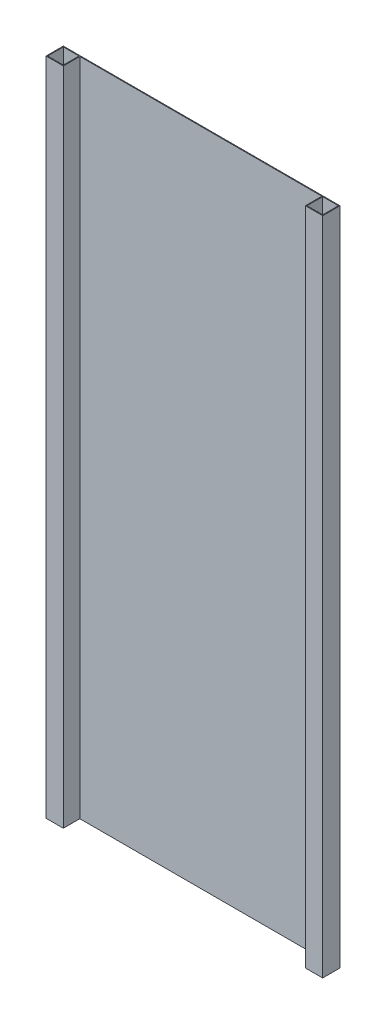
ISO-10303-21;
HEADER;
FILE_DESCRIPTION(('STEP AP214'),'2;1');
FILE_NAME('part.step','',(''),(''),'','','');
FILE_SCHEMA(('AUTOMOTIVE_DESIGN { 1 0 10303 214 1 1 1 1 }'));
ENDSEC;
DATA;
#1=APPLICATION_CONTEXT('core data for automotive mechanical design processes');
#2=APPLICATION_PROTOCOL_DEFINITION('international standard','automotive_design',2000,#1);
#3=PRODUCT_CONTEXT('',#1,'mechanical');
#4=PRODUCT('Part','Part','',(#3));
#5=PRODUCT_RELATED_PRODUCT_CATEGORY('part','',(#4));
#6=PRODUCT_DEFINITION_FORMATION('','',#4);
#7=PRODUCT_DEFINITION_CONTEXT('part definition',#1,'design');
#8=PRODUCT_DEFINITION('design','',#6,#7);
#9=PRODUCT_DEFINITION_SHAPE('','',#8);
#10=(LENGTH_UNIT() NAMED_UNIT(*) SI_UNIT(.MILLI.,.METRE.));
#11=(NAMED_UNIT(*) PLANE_ANGLE_UNIT() SI_UNIT($,.RADIAN.));
#12=(NAMED_UNIT(*) SI_UNIT($,.STERADIAN.) SOLID_ANGLE_UNIT());
#13=UNCERTAINTY_MEASURE_WITH_UNIT(LENGTH_MEASURE(1.E-05),#10,'distance_accuracy_value','');
#14=(GEOMETRIC_REPRESENTATION_CONTEXT(3) GLOBAL_UNCERTAINTY_ASSIGNED_CONTEXT((#13)) GLOBAL_UNIT_ASSIGNED_CONTEXT((#10,
#11,#12)) REPRESENTATION_CONTEXT('',''));
#15=CARTESIAN_POINT('',(0.,0.,0.));
#16=DIRECTION('',(0.,0.,1.));
#17=DIRECTION('',(1.,0.,0.));
#18=AXIS2_PLACEMENT_3D('',#15,#16,#17);
#19=CARTESIAN_POINT('',(-2.64939585421912E-13,840.,1.));
#20=DIRECTION('',(0.,-1.,0.));
#21=DIRECTION('',(1.,0.,0.));
#22=AXIS2_PLACEMENT_3D('',#19,#20,#21);
#23=PLANE('',#22);
#24=DIRECTION('',(-1.,0.,0.));
#25=VECTOR('',#24,1.);
#26=CARTESIAN_POINT('',(-2.64939585421912E-13,840.,0.));
#27=LINE('',#26,#25);
#28=CARTESIAN_POINT('',(0.,840.,0.));
#29=VERTEX_POINT('',#28);
#30=CARTESIAN_POINT('',(-352.,840.,0.));
#31=VERTEX_POINT('',#30);
#32=EDGE_CURVE('E262',#29,#31,#27,.T.);
#33=ORIENTED_EDGE('',*,*,#32,.T.);
#34=DIRECTION('',(0.,0.,-1.));
#35=VECTOR('',#34,1.);
#36=CARTESIAN_POINT('',(-352.,840.,22.));
#37=LINE('',#36,#35);
#38=CARTESIAN_POINT('',(-352.,840.,22.));
#39=VERTEX_POINT('',#38);
#40=EDGE_CURVE('E231',#39,#31,#37,.T.);
#41=ORIENTED_EDGE('',*,*,#40,.F.);
#42=DIRECTION('',(-1.,0.,0.));
#43=VECTOR('',#42,1.);
#44=CARTESIAN_POINT('',(-2.64939585421912E-13,840.,22.));
#45=LINE('',#44,#43);
#46=CARTESIAN_POINT('',(-330.,840.,22.));
#47=VERTEX_POINT('',#46);
#48=EDGE_CURVE('E216',#47,#39,#45,.T.);
#49=ORIENTED_EDGE('',*,*,#48,.F.);
#50=DIRECTION('',(0.,0.,-1.));
#51=VECTOR('',#50,1.);
#52=CARTESIAN_POINT('',(-330.,840.,22.));
#53=LINE('',#52,#51);
#54=CARTESIAN_POINT('',(-330.,840.,1.));
#55=VERTEX_POINT('',#54);
#56=EDGE_CURVE('E234',#47,#55,#53,.T.);
#57=ORIENTED_EDGE('',*,*,#56,.T.);
#58=DIRECTION('',(-1.,0.,0.));
#59=VECTOR('',#58,1.);
#60=CARTESIAN_POINT('',(-2.64939585421912E-13,840.,1.));
#61=LINE('',#60,#59);
#62=CARTESIAN_POINT('',(-21.9999999999999,840.,1.));
#63=VERTEX_POINT('',#62);
#64=EDGE_CURVE('E263',#63,#55,#61,.T.);
#65=ORIENTED_EDGE('',*,*,#64,.F.);
#66=DIRECTION('',(0.,0.,-1.));
#67=VECTOR('',#66,1.);
#68=CARTESIAN_POINT('',(-21.9999999999999,840.,22.));
#69=LINE('',#68,#67);
#70=CARTESIAN_POINT('',(-21.9999999999999,840.,22.));
#71=VERTEX_POINT('',#70);
#72=EDGE_CURVE('E256',#71,#63,#69,.T.);
#73=ORIENTED_EDGE('',*,*,#72,.F.);
#74=DIRECTION('',(-1.,0.,0.));
#75=VECTOR('',#74,1.);
#76=CARTESIAN_POINT('',(-2.64939585421912E-13,840.,22.));
#77=LINE('',#76,#75);
#78=CARTESIAN_POINT('',(0.,840.,22.));
#79=VERTEX_POINT('',#78);
#80=EDGE_CURVE('E241',#79,#71,#77,.T.);
#81=ORIENTED_EDGE('',*,*,#80,.F.);
#82=DIRECTION('',(0.,0.,-1.));
#83=VECTOR('',#82,1.);
#84=CARTESIAN_POINT('',(0.,840.,22.));
#85=LINE('',#84,#83);
#86=EDGE_CURVE('E259',#79,#29,#85,.T.);
#87=ORIENTED_EDGE('',*,*,#86,.T.);
#88=EDGE_LOOP('',(#33,#41,#49,#57,#65,#73,#81,#87));
#89=FACE_BOUND('',#88,.T.);
#90=DIRECTION('',(0.,0.,-1.));
#91=VECTOR('',#90,1.);
#92=CARTESIAN_POINT('',(-1.,840.,0.));
#93=LINE('',#92,#91);
#94=CARTESIAN_POINT('',(-0.999999999999999,840.,21.));
#95=VERTEX_POINT('',#94);
#96=CARTESIAN_POINT('',(-0.999999999999999,840.,0.999999999999995));
#97=VERTEX_POINT('',#96);
#98=EDGE_CURVE('E196',#95,#97,#93,.T.);
#99=ORIENTED_EDGE('',*,*,#98,.F.);
#100=DIRECTION('',(1.,0.,0.));
#101=VECTOR('',#100,1.);
#102=CARTESIAN_POINT('',(-3.39780737724104E-13,840.,21.));
#103=LINE('',#102,#101);
#104=CARTESIAN_POINT('',(-20.9999999999999,840.,21.));
#105=VERTEX_POINT('',#104);
#106=EDGE_CURVE('E177',#105,#95,#103,.T.);
#107=ORIENTED_EDGE('',*,*,#106,.F.);
#108=DIRECTION('',(0.,0.,1.));
#109=VECTOR('',#108,1.);
#110=CARTESIAN_POINT('',(-20.9999999999999,840.,0.));
#111=LINE('',#110,#109);
#112=CARTESIAN_POINT('',(-20.9999999999999,840.,0.999999999999997));
#113=VERTEX_POINT('',#112);
#114=EDGE_CURVE('E185',#113,#105,#111,.T.);
#115=ORIENTED_EDGE('',*,*,#114,.F.);
#116=DIRECTION('',(-1.,0.,0.));
#117=VECTOR('',#116,1.);
#118=CARTESIAN_POINT('',(-3.39677480374344E-13,840.,0.999999999999995));
#119=LINE('',#118,#117);
#120=EDGE_CURVE('E199',#97,#113,#119,.T.);
#121=ORIENTED_EDGE('',*,*,#120,.F.);
#122=EDGE_LOOP('',(#99,#107,#115,#121));
#123=FACE_BOUND('',#122,.T.);
#124=DIRECTION('',(-1.,0.,0.));
#125=VECTOR('',#124,1.);
#126=CARTESIAN_POINT('',(-3.36137818424553E-13,840.,20.9999999999999));
#127=LINE('',#126,#125);
#128=CARTESIAN_POINT('',(-331.,840.,21.));
#129=VERTEX_POINT('',#128);
#130=CARTESIAN_POINT('',(-351.,840.,21.));
#131=VERTEX_POINT('',#130);
#132=EDGE_CURVE('E48',#129,#131,#127,.T.);
#133=ORIENTED_EDGE('',*,*,#132,.T.);
#134=DIRECTION('',(0.,0.,-1.));
#135=VECTOR('',#134,1.);
#136=CARTESIAN_POINT('',(-351.,840.,0.));
#137=LINE('',#136,#135);
#138=CARTESIAN_POINT('',(-351.,840.,1.));
#139=VERTEX_POINT('',#138);
#140=EDGE_CURVE('E162',#131,#139,#137,.T.);
#141=ORIENTED_EDGE('',*,*,#140,.T.);
#142=DIRECTION('',(1.,0.,0.));
#143=VECTOR('',#142,1.);
#144=CARTESIAN_POINT('',(-3.39780737724104E-13,840.,1.));
#145=LINE('',#144,#143);
#146=CARTESIAN_POINT('',(-331.,840.,1.));
#147=VERTEX_POINT('',#146);
#148=EDGE_CURVE('E165',#139,#147,#145,.T.);
#149=ORIENTED_EDGE('',*,*,#148,.T.);
#150=DIRECTION('',(0.,0.,1.));
#151=VECTOR('',#150,1.);
#152=CARTESIAN_POINT('',(-331.,840.,0.));
#153=LINE('',#152,#151);
#154=EDGE_CURVE('E171',#147,#129,#153,.T.);
#155=ORIENTED_EDGE('',*,*,#154,.T.);
#156=EDGE_LOOP('',(#133,#141,#149,#155));
#157=FACE_BOUND('',#156,.T.);
#158=ADVANCED_FACE('F32',(#89,#123,#157),#23,.F.);
#159=CARTESIAN_POINT('',(0.,0.,1.));
#160=DIRECTION('',(0.,-1.,0.));
#161=DIRECTION('',(1.,0.,0.));
#162=AXIS2_PLACEMENT_3D('',#159,#160,#161);
#163=PLANE('',#162);
#164=DIRECTION('',(1.,0.,0.));
#165=VECTOR('',#164,1.);
#166=CARTESIAN_POINT('',(0.,2.22044604925031E-13,21.));
#167=LINE('',#166,#165);
#168=CARTESIAN_POINT('',(-20.9999999999996,2.22044604925031E-13,21.));
#169=VERTEX_POINT('',#168);
#170=CARTESIAN_POINT('',(-0.999999999999734,2.22044604925031E-13,21.));
#171=VERTEX_POINT('',#170);
#172=EDGE_CURVE('E181',#169,#171,#167,.T.);
#173=ORIENTED_EDGE('',*,*,#172,.T.);
#174=DIRECTION('',(0.,0.,-1.));
#175=VECTOR('',#174,1.);
#176=CARTESIAN_POINT('',(-0.999999999999735,2.22044604925031E-13,0.));
#177=LINE('',#176,#175);
#178=CARTESIAN_POINT('',(-0.999999999999735,0.,0.999999999999995));
#179=VERTEX_POINT('',#178);
#180=EDGE_CURVE('E184',#171,#179,#177,.T.);
#181=ORIENTED_EDGE('',*,*,#180,.T.);
#182=DIRECTION('',(-1.,0.,0.));
#183=VECTOR('',#182,1.);
#184=CARTESIAN_POINT('',(0.,2.22044604925031E-13,0.999999999999995));
#185=LINE('',#184,#183);
#186=CARTESIAN_POINT('',(-20.9999999999996,2.22044604925031E-13,0.999999999999997));
#187=VERTEX_POINT('',#186);
#188=EDGE_CURVE('E188',#179,#187,#185,.T.);
#189=ORIENTED_EDGE('',*,*,#188,.T.);
#190=DIRECTION('',(0.,0.,1.));
#191=VECTOR('',#190,1.);
#192=CARTESIAN_POINT('',(-20.9999999999996,2.22044604925031E-13,0.));
#193=LINE('',#192,#191);
#194=EDGE_CURVE('E191',#187,#169,#193,.T.);
#195=ORIENTED_EDGE('',*,*,#194,.T.);
#196=EDGE_LOOP('',(#173,#181,#189,#195));
#197=FACE_BOUND('',#196,.T.);
#198=DIRECTION('',(-1.,0.,0.));
#199=VECTOR('',#198,1.);
#200=CARTESIAN_POINT('',(0.,0.,0.));
#201=LINE('',#200,#199);
#202=CARTESIAN_POINT('',(0.,0.,0.));
#203=VERTEX_POINT('',#202);
#204=CARTESIAN_POINT('',(-352.,0.,0.));
#205=VERTEX_POINT('',#204);
#206=EDGE_CURVE('E35',#203,#205,#201,.T.);
#207=ORIENTED_EDGE('',*,*,#206,.F.);
#208=DIRECTION('',(0.,0.,-1.));
#209=VECTOR('',#208,1.);
#210=CARTESIAN_POINT('',(0.,0.,22.));
#211=LINE('',#210,#209);
#212=CARTESIAN_POINT('',(0.,0.,22.));
#213=VERTEX_POINT('',#212);
#214=EDGE_CURVE('E248',#213,#203,#211,.T.);
#215=ORIENTED_EDGE('',*,*,#214,.F.);
#216=DIRECTION('',(-1.,0.,0.));
#217=VECTOR('',#216,1.);
#218=CARTESIAN_POINT('',(0.,0.,22.));
#219=LINE('',#218,#217);
#220=CARTESIAN_POINT('',(-21.9999999999999,0.,22.));
#221=VERTEX_POINT('',#220);
#222=EDGE_CURVE('E245',#213,#221,#219,.T.);
#223=ORIENTED_EDGE('',*,*,#222,.T.);
#224=DIRECTION('',(0.,0.,-1.));
#225=VECTOR('',#224,1.);
#226=CARTESIAN_POINT('',(-21.9999999999999,0.,22.));
#227=LINE('',#226,#225);
#228=CARTESIAN_POINT('',(-21.9999999999999,0.,1.));
#229=VERTEX_POINT('',#228);
#230=EDGE_CURVE('E253',#221,#229,#227,.T.);
#231=ORIENTED_EDGE('',*,*,#230,.T.);
#232=DIRECTION('',(-1.,0.,0.));
#233=VECTOR('',#232,1.);
#234=CARTESIAN_POINT('',(0.,0.,1.));
#235=LINE('',#234,#233);
#236=CARTESIAN_POINT('',(-330.,0.,1.));
#237=VERTEX_POINT('',#236);
#238=EDGE_CURVE('E40',#229,#237,#235,.T.);
#239=ORIENTED_EDGE('',*,*,#238,.T.);
#240=DIRECTION('',(0.,0.,-1.));
#241=VECTOR('',#240,1.);
#242=CARTESIAN_POINT('',(-330.,0.,22.));
#243=LINE('',#242,#241);
#244=CARTESIAN_POINT('',(-330.,0.,22.));
#245=VERTEX_POINT('',#244);
#246=EDGE_CURVE('E224',#245,#237,#243,.T.);
#247=ORIENTED_EDGE('',*,*,#246,.F.);
#248=DIRECTION('',(-1.,0.,0.));
#249=VECTOR('',#248,1.);
#250=CARTESIAN_POINT('',(0.,0.,22.));
#251=LINE('',#250,#249);
#252=CARTESIAN_POINT('',(-352.,0.,22.));
#253=VERTEX_POINT('',#252);
#254=EDGE_CURVE('E221',#245,#253,#251,.T.);
#255=ORIENTED_EDGE('',*,*,#254,.T.);
#256=DIRECTION('',(0.,0.,-1.));
#257=VECTOR('',#256,1.);
#258=CARTESIAN_POINT('',(-352.,0.,22.));
#259=LINE('',#258,#257);
#260=EDGE_CURVE('E228',#253,#205,#259,.T.);
#261=ORIENTED_EDGE('',*,*,#260,.T.);
#262=EDGE_LOOP('',(#207,#215,#223,#231,#239,#247,#255,#261));
#263=FACE_BOUND('',#262,.T.);
#264=DIRECTION('',(0.,0.,-1.));
#265=VECTOR('',#264,1.);
#266=CARTESIAN_POINT('',(-351.,1.11022302462516E-13,0.));
#267=LINE('',#266,#265);
#268=CARTESIAN_POINT('',(-351.,1.11022302462516E-13,21.));
#269=VERTEX_POINT('',#268);
#270=CARTESIAN_POINT('',(-351.,1.11022302462516E-13,1.));
#271=VERTEX_POINT('',#270);
#272=EDGE_CURVE('E158',#269,#271,#267,.T.);
#273=ORIENTED_EDGE('',*,*,#272,.F.);
#274=DIRECTION('',(-1.,0.,0.));
#275=VECTOR('',#274,1.);
#276=CARTESIAN_POINT('',(0.,2.22044604925031E-13,20.9999999999999));
#277=LINE('',#276,#275);
#278=CARTESIAN_POINT('',(-331.,1.11022302462516E-13,21.));
#279=VERTEX_POINT('',#278);
#280=EDGE_CURVE('E154',#279,#269,#277,.T.);
#281=ORIENTED_EDGE('',*,*,#280,.F.);
#282=DIRECTION('',(0.,0.,1.));
#283=VECTOR('',#282,1.);
#284=CARTESIAN_POINT('',(-331.,1.11022302462516E-13,0.));
#285=LINE('',#284,#283);
#286=CARTESIAN_POINT('',(-331.,0.,1.));
#287=VERTEX_POINT('',#286);
#288=EDGE_CURVE('E146',#287,#279,#285,.T.);
#289=ORIENTED_EDGE('',*,*,#288,.F.);
#290=DIRECTION('',(1.,0.,0.));
#291=VECTOR('',#290,1.);
#292=CARTESIAN_POINT('',(0.,2.22044604925031E-13,1.));
#293=LINE('',#292,#291);
#294=EDGE_CURVE('E153',#271,#287,#293,.T.);
#295=ORIENTED_EDGE('',*,*,#294,.F.);
#296=EDGE_LOOP('',(#273,#281,#289,#295));
#297=FACE_BOUND('',#296,.T.);
#298=ADVANCED_FACE('F161',(#197,#263,#297),#163,.T.);
#299=CARTESIAN_POINT('',(0.,0.,1.));
#300=DIRECTION('',(0.,0.,1.));
#301=DIRECTION('',(1.,0.,0.));
#302=AXIS2_PLACEMENT_3D('',#299,#300,#301);
#303=PLANE('',#302);
#304=ORIENTED_EDGE('',*,*,#64,.T.);
#305=DIRECTION('',(0.,-1.,0.));
#306=VECTOR('',#305,1.);
#307=CARTESIAN_POINT('',(-330.,0.,1.));
#308=LINE('',#307,#306);
#309=EDGE_CURVE('E266',#55,#237,#308,.T.);
#310=ORIENTED_EDGE('',*,*,#309,.T.);
#311=ORIENTED_EDGE('',*,*,#238,.F.);
#312=DIRECTION('',(0.,-1.,0.));
#313=VECTOR('',#312,1.);
#314=CARTESIAN_POINT('',(-21.9999999999999,0.,1.));
#315=LINE('',#314,#313);
#316=EDGE_CURVE('E11',#63,#229,#315,.T.);
#317=ORIENTED_EDGE('',*,*,#316,.F.);
#318=EDGE_LOOP('',(#304,#310,#311,#317));
#319=FACE_BOUND('',#318,.T.);
#320=ADVANCED_FACE('F289',(#319),#303,.T.);
#321=CARTESIAN_POINT('',(0.,0.,0.));
#322=DIRECTION('',(0.,0.,1.));
#323=DIRECTION('',(1.,0.,0.));
#324=AXIS2_PLACEMENT_3D('',#321,#322,#323);
#325=PLANE('',#324);
#326=ORIENTED_EDGE('',*,*,#32,.F.);
#327=DIRECTION('',(0.,1.,0.));
#328=VECTOR('',#327,1.);
#329=CARTESIAN_POINT('',(0.,0.,0.));
#330=LINE('',#329,#328);
#331=EDGE_CURVE('E237',#203,#29,#330,.T.);
#332=ORIENTED_EDGE('',*,*,#331,.F.);
#333=ORIENTED_EDGE('',*,*,#206,.T.);
#334=DIRECTION('',(0.,1.,0.));
#335=VECTOR('',#334,1.);
#336=CARTESIAN_POINT('',(-352.,0.,0.));
#337=LINE('',#336,#335);
#338=EDGE_CURVE('E206',#205,#31,#337,.T.);
#339=ORIENTED_EDGE('',*,*,#338,.T.);
#340=EDGE_LOOP('',(#326,#332,#333,#339));
#341=FACE_BOUND('',#340,.T.);
#342=ADVANCED_FACE('F274',(#341),#325,.F.);
#343=CARTESIAN_POINT('',(-21.9999999999999,0.,22.));
#344=DIRECTION('',(1.,0.,0.));
#345=DIRECTION('',(0.,0.,-1.));
#346=AXIS2_PLACEMENT_3D('',#343,#344,#345);
#347=PLANE('',#346);
#348=ORIENTED_EDGE('',*,*,#72,.T.);
#349=ORIENTED_EDGE('',*,*,#316,.T.);
#350=ORIENTED_EDGE('',*,*,#230,.F.);
#351=DIRECTION('',(0.,-1.,0.));
#352=VECTOR('',#351,1.);
#353=CARTESIAN_POINT('',(-21.9999999999999,0.,22.));
#354=LINE('',#353,#352);
#355=EDGE_CURVE('E243',#71,#221,#354,.T.);
#356=ORIENTED_EDGE('',*,*,#355,.F.);
#357=EDGE_LOOP('',(#348,#349,#350,#356));
#358=FACE_BOUND('',#357,.T.);
#359=ADVANCED_FACE('F295',(#358),#347,.F.);
#360=CARTESIAN_POINT('',(0.,0.,22.));
#361=DIRECTION('',(-1.,0.,0.));
#362=DIRECTION('',(0.,0.,1.));
#363=AXIS2_PLACEMENT_3D('',#360,#361,#362);
#364=PLANE('',#363);
#365=ORIENTED_EDGE('',*,*,#331,.T.);
#366=ORIENTED_EDGE('',*,*,#86,.F.);
#367=DIRECTION('',(0.,1.,0.));
#368=VECTOR('',#367,1.);
#369=CARTESIAN_POINT('',(0.,0.,22.));
#370=LINE('',#369,#368);
#371=EDGE_CURVE('E238',#213,#79,#370,.T.);
#372=ORIENTED_EDGE('',*,*,#371,.F.);
#373=ORIENTED_EDGE('',*,*,#214,.T.);
#374=EDGE_LOOP('',(#365,#366,#372,#373));
#375=FACE_BOUND('',#374,.T.);
#376=ADVANCED_FACE('F302',(#375),#364,.F.);
#377=CARTESIAN_POINT('',(0.,0.,22.));
#378=DIRECTION('',(0.,0.,1.));
#379=DIRECTION('',(1.,0.,0.));
#380=AXIS2_PLACEMENT_3D('',#377,#378,#379);
#381=PLANE('',#380);
#382=ORIENTED_EDGE('',*,*,#371,.T.);
#383=ORIENTED_EDGE('',*,*,#80,.T.);
#384=ORIENTED_EDGE('',*,*,#355,.T.);
#385=ORIENTED_EDGE('',*,*,#222,.F.);
#386=EDGE_LOOP('',(#382,#383,#384,#385));
#387=FACE_BOUND('',#386,.T.);
#388=ADVANCED_FACE('F300',(#387),#381,.T.);
#389=CARTESIAN_POINT('',(-330.,0.,22.));
#390=DIRECTION('',(1.,0.,0.));
#391=DIRECTION('',(0.,0.,-1.));
#392=AXIS2_PLACEMENT_3D('',#389,#390,#391);
#393=PLANE('',#392);
#394=ORIENTED_EDGE('',*,*,#309,.F.);
#395=ORIENTED_EDGE('',*,*,#56,.F.);
#396=DIRECTION('',(0.,-1.,0.));
#397=VECTOR('',#396,1.);
#398=CARTESIAN_POINT('',(-330.,0.,22.));
#399=LINE('',#398,#397);
#400=EDGE_CURVE('E213',#47,#245,#399,.T.);
#401=ORIENTED_EDGE('',*,*,#400,.T.);
#402=ORIENTED_EDGE('',*,*,#246,.T.);
#403=EDGE_LOOP('',(#394,#395,#401,#402));
#404=FACE_BOUND('',#403,.T.);
#405=ADVANCED_FACE('F287',(#404),#393,.T.);
#406=CARTESIAN_POINT('',(-352.,0.,22.));
#407=DIRECTION('',(-1.,0.,0.));
#408=DIRECTION('',(0.,-1.,0.));
#409=AXIS2_PLACEMENT_3D('',#406,#407,#408);
#410=PLANE('',#409);
#411=ORIENTED_EDGE('',*,*,#338,.F.);
#412=ORIENTED_EDGE('',*,*,#260,.F.);
#413=DIRECTION('',(0.,1.,0.));
#414=VECTOR('',#413,1.);
#415=CARTESIAN_POINT('',(-352.,0.,22.));
#416=LINE('',#415,#414);
#417=EDGE_CURVE('E218',#253,#39,#416,.T.);
#418=ORIENTED_EDGE('',*,*,#417,.T.);
#419=ORIENTED_EDGE('',*,*,#40,.T.);
#420=EDGE_LOOP('',(#411,#412,#418,#419));
#421=FACE_BOUND('',#420,.T.);
#422=ADVANCED_FACE('F280',(#421),#410,.T.);
#423=CARTESIAN_POINT('',(0.,0.,22.));
#424=DIRECTION('',(0.,0.,1.));
#425=DIRECTION('',(1.,0.,0.));
#426=AXIS2_PLACEMENT_3D('',#423,#424,#425);
#427=PLANE('',#426);
#428=ORIENTED_EDGE('',*,*,#400,.F.);
#429=ORIENTED_EDGE('',*,*,#48,.T.);
#430=ORIENTED_EDGE('',*,*,#417,.F.);
#431=ORIENTED_EDGE('',*,*,#254,.F.);
#432=EDGE_LOOP('',(#428,#429,#430,#431));
#433=FACE_BOUND('',#432,.T.);
#434=ADVANCED_FACE('F285',(#433),#427,.T.);
#435=CARTESIAN_POINT('',(0.,2.22044604925031E-13,21.));
#436=DIRECTION('',(0.,0.,1.));
#437=DIRECTION('',(1.,0.,0.));
#438=AXIS2_PLACEMENT_3D('',#435,#436,#437);
#439=PLANE('',#438);
#440=ORIENTED_EDGE('',*,*,#106,.T.);
#441=DIRECTION('',(0.,1.,0.));
#442=VECTOR('',#441,1.);
#443=CARTESIAN_POINT('',(-0.999999999999734,2.22044604925031E-13,21.));
#444=LINE('',#443,#442);
#445=EDGE_CURVE('E194',#171,#95,#444,.T.);
#446=ORIENTED_EDGE('',*,*,#445,.F.);
#447=ORIENTED_EDGE('',*,*,#172,.F.);
#448=DIRECTION('',(0.,1.,0.));
#449=VECTOR('',#448,1.);
#450=CARTESIAN_POINT('',(-20.9999999999996,2.22044604925031E-13,21.));
#451=LINE('',#450,#449);
#452=EDGE_CURVE('E204',#169,#105,#451,.T.);
#453=ORIENTED_EDGE('',*,*,#452,.T.);
#454=EDGE_LOOP('',(#440,#446,#447,#453));
#455=FACE_BOUND('',#454,.T.);
#456=ADVANCED_FACE('F367',(#455),#439,.F.);
#457=CARTESIAN_POINT('',(-20.9999999999996,2.22044604925031E-13,0.));
#458=DIRECTION('',(-1.,0.,0.));
#459=DIRECTION('',(0.,-1.,0.));
#460=AXIS2_PLACEMENT_3D('',#457,#458,#459);
#461=PLANE('',#460);
#462=ORIENTED_EDGE('',*,*,#114,.T.);
#463=ORIENTED_EDGE('',*,*,#452,.F.);
#464=ORIENTED_EDGE('',*,*,#194,.F.);
#465=DIRECTION('',(0.,1.,0.));
#466=VECTOR('',#465,1.);
#467=CARTESIAN_POINT('',(-20.9999999999996,2.22044604925031E-13,0.999999999999997));
#468=LINE('',#467,#466);
#469=EDGE_CURVE('E207',#187,#113,#468,.T.);
#470=ORIENTED_EDGE('',*,*,#469,.T.);
#471=EDGE_LOOP('',(#462,#463,#464,#470));
#472=FACE_BOUND('',#471,.T.);
#473=ADVANCED_FACE('F376',(#472),#461,.F.);
#474=CARTESIAN_POINT('',(0.,2.22044604925031E-13,0.999999999999995));
#475=DIRECTION('',(0.,0.,-1.));
#476=DIRECTION('',(-1.,0.,0.));
#477=AXIS2_PLACEMENT_3D('',#474,#475,#476);
#478=PLANE('',#477);
#479=ORIENTED_EDGE('',*,*,#120,.T.);
#480=ORIENTED_EDGE('',*,*,#469,.F.);
#481=ORIENTED_EDGE('',*,*,#188,.F.);
#482=DIRECTION('',(0.,1.,0.));
#483=VECTOR('',#482,1.);
#484=CARTESIAN_POINT('',(-0.999999999999734,2.22044604925031E-13,0.999999999999995));
#485=LINE('',#484,#483);
#486=EDGE_CURVE('E209',#179,#97,#485,.T.);
#487=ORIENTED_EDGE('',*,*,#486,.T.);
#488=EDGE_LOOP('',(#479,#480,#481,#487));
#489=FACE_BOUND('',#488,.T.);
#490=ADVANCED_FACE('F386',(#489),#478,.F.);
#491=CARTESIAN_POINT('',(-0.999999999999735,2.22044604925031E-13,0.));
#492=DIRECTION('',(1.,0.,0.));
#493=DIRECTION('',(0.,1.,0.));
#494=AXIS2_PLACEMENT_3D('',#491,#492,#493);
#495=PLANE('',#494);
#496=ORIENTED_EDGE('',*,*,#98,.T.);
#497=ORIENTED_EDGE('',*,*,#486,.F.);
#498=ORIENTED_EDGE('',*,*,#180,.F.);
#499=ORIENTED_EDGE('',*,*,#445,.T.);
#500=EDGE_LOOP('',(#496,#497,#498,#499));
#501=FACE_BOUND('',#500,.T.);
#502=ADVANCED_FACE('F396',(#501),#495,.F.);
#503=CARTESIAN_POINT('',(0.,2.22044604925031E-13,20.9999999999999));
#504=DIRECTION('',(0.,0.,-1.));
#505=DIRECTION('',(-1.,0.,0.));
#506=AXIS2_PLACEMENT_3D('',#503,#504,#505);
#507=PLANE('',#506);
#508=ORIENTED_EDGE('',*,*,#132,.F.);
#509=DIRECTION('',(0.,1.,0.));
#510=VECTOR('',#509,1.);
#511=CARTESIAN_POINT('',(-331.,1.11022302462516E-13,21.));
#512=LINE('',#511,#510);
#513=EDGE_CURVE('E148',#279,#129,#512,.T.);
#514=ORIENTED_EDGE('',*,*,#513,.F.);
#515=ORIENTED_EDGE('',*,*,#280,.T.);
#516=DIRECTION('',(0.,1.,0.));
#517=VECTOR('',#516,1.);
#518=CARTESIAN_POINT('',(-351.,1.11022302462516E-13,21.));
#519=LINE('',#518,#517);
#520=EDGE_CURVE('E175',#269,#131,#519,.T.);
#521=ORIENTED_EDGE('',*,*,#520,.T.);
#522=EDGE_LOOP('',(#508,#514,#515,#521));
#523=FACE_BOUND('',#522,.T.);
#524=ADVANCED_FACE('F156',(#523),#507,.T.);
#525=CARTESIAN_POINT('',(-351.,1.11022302462516E-13,0.));
#526=DIRECTION('',(1.,0.,0.));
#527=DIRECTION('',(0.,1.,0.));
#528=AXIS2_PLACEMENT_3D('',#525,#526,#527);
#529=PLANE('',#528);
#530=ORIENTED_EDGE('',*,*,#140,.F.);
#531=ORIENTED_EDGE('',*,*,#520,.F.);
#532=ORIENTED_EDGE('',*,*,#272,.T.);
#533=DIRECTION('',(0.,1.,0.));
#534=VECTOR('',#533,1.);
#535=CARTESIAN_POINT('',(-351.,1.11022302462516E-13,1.));
#536=LINE('',#535,#534);
#537=EDGE_CURVE('E178',#271,#139,#536,.T.);
#538=ORIENTED_EDGE('',*,*,#537,.T.);
#539=EDGE_LOOP('',(#530,#531,#532,#538));
#540=FACE_BOUND('',#539,.T.);
#541=ADVANCED_FACE('F427',(#540),#529,.T.);
#542=CARTESIAN_POINT('',(0.,2.22044604925031E-13,1.));
#543=DIRECTION('',(0.,0.,1.));
#544=DIRECTION('',(1.,0.,0.));
#545=AXIS2_PLACEMENT_3D('',#542,#543,#544);
#546=PLANE('',#545);
#547=ORIENTED_EDGE('',*,*,#148,.F.);
#548=ORIENTED_EDGE('',*,*,#537,.F.);
#549=ORIENTED_EDGE('',*,*,#294,.T.);
#550=DIRECTION('',(0.,1.,0.));
#551=VECTOR('',#550,1.);
#552=CARTESIAN_POINT('',(-331.,1.11022302462516E-13,1.));
#553=LINE('',#552,#551);
#554=EDGE_CURVE('E56',#287,#147,#553,.T.);
#555=ORIENTED_EDGE('',*,*,#554,.T.);
#556=EDGE_LOOP('',(#547,#548,#549,#555));
#557=FACE_BOUND('',#556,.T.);
#558=ADVANCED_FACE('F436',(#557),#546,.T.);
#559=CARTESIAN_POINT('',(-331.,1.11022302462516E-13,0.));
#560=DIRECTION('',(-1.,0.,0.));
#561=DIRECTION('',(0.,-1.,0.));
#562=AXIS2_PLACEMENT_3D('',#559,#560,#561);
#563=PLANE('',#562);
#564=ORIENTED_EDGE('',*,*,#154,.F.);
#565=ORIENTED_EDGE('',*,*,#554,.F.);
#566=ORIENTED_EDGE('',*,*,#288,.T.);
#567=ORIENTED_EDGE('',*,*,#513,.T.);
#568=EDGE_LOOP('',(#564,#565,#566,#567));
#569=FACE_BOUND('',#568,.T.);
#570=ADVANCED_FACE('F147',(#569),#563,.T.);
#571=CLOSED_SHELL('',(#158,#298,#320,#342,#359,#376,#388,#405,#422,#434,#456,#473,#490,#502,
#524,#541,#558,#570));
#572=MANIFOLD_SOLID_BREP('B2',#571);
#573=ADVANCED_BREP_SHAPE_REPRESENTATION('',(#18,#572),#14);
#574=SHAPE_DEFINITION_REPRESENTATION(#9,#573);
ENDSEC;
END-ISO-10303-21;
